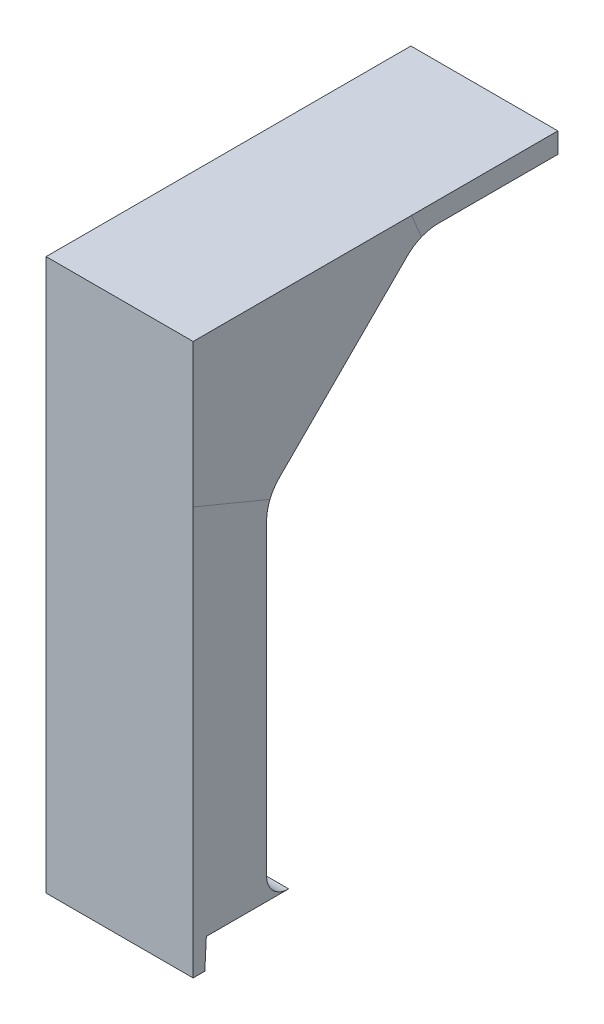
ISO-10303-21;
HEADER;
FILE_DESCRIPTION(('STEP AP214'),'2;1');
FILE_NAME('part.step','',(''),(''),'','','');
FILE_SCHEMA(('AUTOMOTIVE_DESIGN { 1 0 10303 214 1 1 1 1 }'));
ENDSEC;
DATA;
#1=APPLICATION_CONTEXT('core data for automotive mechanical design processes');
#2=APPLICATION_PROTOCOL_DEFINITION('international standard','automotive_design',2000,#1);
#3=PRODUCT_CONTEXT('',#1,'mechanical');
#4=PRODUCT('Part','Part','',(#3));
#5=PRODUCT_RELATED_PRODUCT_CATEGORY('part','',(#4));
#6=PRODUCT_DEFINITION_FORMATION('','',#4);
#7=PRODUCT_DEFINITION_CONTEXT('part definition',#1,'design');
#8=PRODUCT_DEFINITION('design','',#6,#7);
#9=PRODUCT_DEFINITION_SHAPE('','',#8);
#10=(LENGTH_UNIT() NAMED_UNIT(*) SI_UNIT(.MILLI.,.METRE.));
#11=(NAMED_UNIT(*) PLANE_ANGLE_UNIT() SI_UNIT($,.RADIAN.));
#12=(NAMED_UNIT(*) SI_UNIT($,.STERADIAN.) SOLID_ANGLE_UNIT());
#13=UNCERTAINTY_MEASURE_WITH_UNIT(LENGTH_MEASURE(1.E-05),#10,'distance_accuracy_value','');
#14=(GEOMETRIC_REPRESENTATION_CONTEXT(3) GLOBAL_UNCERTAINTY_ASSIGNED_CONTEXT((#13)) GLOBAL_UNIT_ASSIGNED_CONTEXT((#10,
#11,#12)) REPRESENTATION_CONTEXT('',''));
#15=CARTESIAN_POINT('',(0.,0.,0.));
#16=DIRECTION('',(0.,0.,1.));
#17=DIRECTION('',(1.,0.,0.));
#18=AXIS2_PLACEMENT_3D('',#15,#16,#17);
#19=CARTESIAN_POINT('',(0.,5.,0.));
#20=DIRECTION('',(0.,1.,0.));
#21=DIRECTION('',(0.,0.,1.));
#22=AXIS2_PLACEMENT_3D('',#19,#20,#21);
#23=PLANE('',#22);
#24=DIRECTION('',(0.,0.,-1.));
#25=VECTOR('',#24,1.);
#26=CARTESIAN_POINT('',(-31.5,5.,10.));
#27=LINE('',#26,#25);
#28=CARTESIAN_POINT('',(-31.5,5.,64.1000000000001));
#29=VERTEX_POINT('',#28);
#30=CARTESIAN_POINT('',(-31.5,5.,58.5000000000001));
#31=VERTEX_POINT('',#30);
#32=EDGE_CURVE('E206',#29,#31,#27,.T.);
#33=ORIENTED_EDGE('',*,*,#32,.F.);
#34=DIRECTION('',(-1.,0.,0.));
#35=VECTOR('',#34,1.);
#36=CARTESIAN_POINT('',(0.,5.,64.1000000000001));
#37=LINE('',#36,#35);
#38=CARTESIAN_POINT('',(-41.5,5.,64.1000000000001));
#39=VERTEX_POINT('',#38);
#40=EDGE_CURVE('E222',#29,#39,#37,.T.);
#41=ORIENTED_EDGE('',*,*,#40,.T.);
#42=DIRECTION('',(0.,0.,1.));
#43=VECTOR('',#42,1.);
#44=CARTESIAN_POINT('',(-41.5,5.,10.));
#45=LINE('',#44,#43);
#46=CARTESIAN_POINT('',(-41.5,5.,58.5000000000001));
#47=VERTEX_POINT('',#46);
#48=EDGE_CURVE('E36',#47,#39,#45,.T.);
#49=ORIENTED_EDGE('',*,*,#48,.F.);
#50=DIRECTION('',(-1.,0.,0.));
#51=VECTOR('',#50,1.);
#52=CARTESIAN_POINT('',(0.,5.,58.5000000000001));
#53=LINE('',#52,#51);
#54=EDGE_CURVE('E202',#47,#31,#53,.F.);
#55=ORIENTED_EDGE('',*,*,#54,.T.);
#56=EDGE_LOOP('',(#33,#41,#49,#55));
#57=FACE_BOUND('',#56,.T.);
#58=ADVANCED_FACE('F32',(#57),#23,.F.);
#59=CARTESIAN_POINT('',(0.,-20.8862915010153,40.1862915010152));
#60=DIRECTION('',(0.,0.,1.));
#61=DIRECTION('',(0.,-1.,0.));
#62=AXIS2_PLACEMENT_3D('',#59,#60,#61);
#63=PLANE('',#62);
#64=DIRECTION('',(0.,1.,0.));
#65=VECTOR('',#64,1.);
#66=CARTESIAN_POINT('',(-41.5,44.1137084989847,40.1862915010153));
#67=LINE('',#66,#65);
#68=CARTESIAN_POINT('',(-41.5,39.1137084989847,40.1862915010153));
#69=VERTEX_POINT('',#68);
#70=CARTESIAN_POINT('',(-41.5,40.5,40.1862915010153));
#71=VERTEX_POINT('',#70);
#72=EDGE_CURVE('E186',#69,#71,#67,.T.);
#73=ORIENTED_EDGE('',*,*,#72,.T.);
#74=DIRECTION('',(1.,0.,0.));
#75=VECTOR('',#74,1.);
#76=CARTESIAN_POINT('',(0.,40.5,40.1862915010153));
#77=LINE('',#76,#75);
#78=CARTESIAN_POINT('',(-31.5,40.5,40.1862915010153));
#79=VERTEX_POINT('',#78);
#80=EDGE_CURVE('E182',#71,#79,#77,.T.);
#81=ORIENTED_EDGE('',*,*,#80,.T.);
#82=DIRECTION('',(0.,-1.,0.));
#83=VECTOR('',#82,1.);
#84=CARTESIAN_POINT('',(-31.5,44.1137084989847,40.1862915010153));
#85=LINE('',#84,#83);
#86=CARTESIAN_POINT('',(-31.5,39.1137084989847,40.1862915010153));
#87=VERTEX_POINT('',#86);
#88=EDGE_CURVE('E185',#79,#87,#85,.T.);
#89=ORIENTED_EDGE('',*,*,#88,.T.);
#90=DIRECTION('',(-1.,0.,0.));
#91=VECTOR('',#90,1.);
#92=CARTESIAN_POINT('',(-41.5,39.1137084989847,40.1862915010153));
#93=LINE('',#92,#91);
#94=EDGE_CURVE('E199',#87,#69,#93,.T.);
#95=ORIENTED_EDGE('',*,*,#94,.T.);
#96=EDGE_LOOP('',(#73,#81,#89,#95));
#97=FACE_BOUND('',#96,.T.);
#98=ADVANCED_FACE('F34',(#97),#63,.F.);
#99=CARTESIAN_POINT('',(-41.5,39.1137084989847,51.8810137161517));
#100=DIRECTION('',(0.,-1.,0.));
#101=DIRECTION('',(0.,0.,-1.));
#102=AXIS2_PLACEMENT_3D('',#99,#100,#101);
#103=PLANE('',#102);
#104=DIRECTION('',(0.,0.,-1.));
#105=VECTOR('',#104,1.);
#106=CARTESIAN_POINT('',(-31.5,39.1137084989847,51.8810137161517));
#107=LINE('',#106,#105);
#108=CARTESIAN_POINT('',(-31.5,39.1137084989847,48.3223304703363));
#109=VERTEX_POINT('',#108);
#110=EDGE_CURVE('E240',#109,#87,#107,.T.);
#111=ORIENTED_EDGE('',*,*,#110,.F.);
#112=DIRECTION('',(1.,0.,0.));
#113=VECTOR('',#112,1.);
#114=CARTESIAN_POINT('',(-41.5,39.1137084989847,48.3223304703363));
#115=LINE('',#114,#113);
#116=CARTESIAN_POINT('',(-41.5,39.1137084989847,48.3223304703363));
#117=VERTEX_POINT('',#116);
#118=EDGE_CURVE('E252',#109,#117,#115,.F.);
#119=ORIENTED_EDGE('',*,*,#118,.T.);
#120=DIRECTION('',(0.,0.,-1.));
#121=VECTOR('',#120,1.);
#122=CARTESIAN_POINT('',(-41.5,39.1137084989847,51.8810137161517));
#123=LINE('',#122,#121);
#124=EDGE_CURVE('E238',#117,#69,#123,.T.);
#125=ORIENTED_EDGE('',*,*,#124,.T.);
#126=ORIENTED_EDGE('',*,*,#94,.F.);
#127=EDGE_LOOP('',(#111,#119,#125,#126));
#128=FACE_BOUND('',#127,.T.);
#129=ADVANCED_FACE('F312',(#128),#103,.T.);
#130=CARTESIAN_POINT('',(-41.5,44.1137084989847,51.8810137161517));
#131=DIRECTION('',(-1.,0.,0.));
#132=DIRECTION('',(0.,0.,1.));
#133=AXIS2_PLACEMENT_3D('',#130,#131,#132);
#134=PLANE('',#133);
#135=DIRECTION('',(0.,0.,1.));
#136=VECTOR('',#135,1.);
#137=CARTESIAN_POINT('',(-41.5,40.5,51.8810137161517));
#138=LINE('',#137,#136);
#139=CARTESIAN_POINT('',(-41.5,40.5,50.1391918985787));
#140=VERTEX_POINT('',#139);
#141=EDGE_CURVE('E11',#71,#140,#138,.T.);
#142=ORIENTED_EDGE('',*,*,#141,.F.);
#143=ORIENTED_EDGE('',*,*,#72,.F.);
#144=ORIENTED_EDGE('',*,*,#124,.F.);
#145=CARTESIAN_POINT('',(-41.5,36.1137084989847,48.3223304703363));
#146=DIRECTION('',(-1.,0.,0.));
#147=DIRECTION('',(0.,0.,1.));
#148=AXIS2_PLACEMENT_3D('',#145,#146,#147);
#149=CIRCLE('',#148,3.);
#150=CARTESIAN_POINT('',(-41.5,38.8853470965186,49.4703807674316));
#151=VERTEX_POINT('',#150);
#152=EDGE_CURVE('E234',#117,#151,#149,.F.);
#153=ORIENTED_EDGE('',*,*,#152,.T.);
#154=DIRECTION('',(0.,-0.923879532511287,-0.382683432365089));
#155=VECTOR('',#154,1.);
#156=CARTESIAN_POINT('',(-41.5,37.3451163312936,48.8323962952911));
#157=LINE('',#156,#155);
#158=EDGE_CURVE('E189',#140,#151,#157,.T.);
#159=ORIENTED_EDGE('',*,*,#158,.F.);
#160=EDGE_LOOP('',(#142,#143,#144,#153,#159));
#161=FACE_BOUND('',#160,.T.);
#162=ADVANCED_FACE('F307',(#161),#134,.T.);
#163=CARTESIAN_POINT('',(-31.5,44.1137084989847,51.8810137161517));
#164=DIRECTION('',(1.,0.,0.));
#165=DIRECTION('',(0.,0.,-1.));
#166=AXIS2_PLACEMENT_3D('',#163,#164,#165);
#167=PLANE('',#166);
#168=DIRECTION('',(0.,0.,-1.));
#169=VECTOR('',#168,1.);
#170=CARTESIAN_POINT('',(-31.5,40.5,51.8810137161517));
#171=LINE('',#170,#169);
#172=CARTESIAN_POINT('',(-31.5,40.5,50.1391918985787));
#173=VERTEX_POINT('',#172);
#174=EDGE_CURVE('E42',#173,#79,#171,.T.);
#175=ORIENTED_EDGE('',*,*,#174,.F.);
#176=DIRECTION('',(0.,0.923879532511287,0.382683432365089));
#177=VECTOR('',#176,1.);
#178=CARTESIAN_POINT('',(-31.5,37.3451163312936,48.8323962952911));
#179=LINE('',#178,#177);
#180=CARTESIAN_POINT('',(-31.5,38.8853470965186,49.4703807674316));
#181=VERTEX_POINT('',#180);
#182=EDGE_CURVE('E193',#181,#173,#179,.T.);
#183=ORIENTED_EDGE('',*,*,#182,.F.);
#184=CARTESIAN_POINT('',(-31.5,36.1137084989847,48.3223304703363));
#185=DIRECTION('',(1.,0.,0.));
#186=DIRECTION('',(0.,0.,-1.));
#187=AXIS2_PLACEMENT_3D('',#184,#185,#186);
#188=CIRCLE('',#187,3.);
#189=EDGE_CURVE('E237',#181,#109,#188,.F.);
#190=ORIENTED_EDGE('',*,*,#189,.T.);
#191=ORIENTED_EDGE('',*,*,#110,.T.);
#192=ORIENTED_EDGE('',*,*,#88,.F.);
#193=EDGE_LOOP('',(#175,#183,#190,#191,#192));
#194=FACE_BOUND('',#193,.T.);
#195=ADVANCED_FACE('F316',(#194),#167,.T.);
#196=CARTESIAN_POINT('',(-41.5,36.1137084989847,48.3223304703363));
#197=DIRECTION('',(-1.,0.,0.));
#198=DIRECTION('',(0.,0.,1.));
#199=AXIS2_PLACEMENT_3D('',#196,#197,#198);
#200=CYLINDRICAL_SURFACE('',#199,3.);
#201=ORIENTED_EDGE('',*,*,#152,.F.);
#202=ORIENTED_EDGE('',*,*,#118,.F.);
#203=ORIENTED_EDGE('',*,*,#189,.F.);
#204=CARTESIAN_POINT('',(-31.5,36.1137084989847,48.3223304703363));
#205=DIRECTION('',(1.,0.,0.));
#206=DIRECTION('',(0.,0.,-1.));
#207=AXIS2_PLACEMENT_3D('',#204,#205,#206);
#208=CIRCLE('',#207,3.);
#209=CARTESIAN_POINT('',(-31.5,38.2350288425444,50.443650813896));
#210=VERTEX_POINT('',#209);
#211=EDGE_CURVE('E197',#210,#181,#208,.F.);
#212=ORIENTED_EDGE('',*,*,#211,.F.);
#213=DIRECTION('',(1.,0.,0.));
#214=VECTOR('',#213,1.);
#215=CARTESIAN_POINT('',(-31.5,38.2350288425444,50.443650813896));
#216=LINE('',#215,#214);
#217=CARTESIAN_POINT('',(-41.5,38.2350288425444,50.443650813896));
#218=VERTEX_POINT('',#217);
#219=EDGE_CURVE('E192',#218,#210,#216,.T.);
#220=ORIENTED_EDGE('',*,*,#219,.F.);
#221=CARTESIAN_POINT('',(-41.5,36.1137084989847,48.3223304703363));
#222=DIRECTION('',(-1.,0.,0.));
#223=DIRECTION('',(0.,0.,1.));
#224=AXIS2_PLACEMENT_3D('',#221,#222,#223);
#225=CIRCLE('',#224,3.);
#226=EDGE_CURVE('E191',#151,#218,#225,.F.);
#227=ORIENTED_EDGE('',*,*,#226,.F.);
#228=EDGE_LOOP('',(#201,#202,#203,#212,#220,#227));
#229=FACE_BOUND('',#228,.T.);
#230=ADVANCED_FACE('F298',(#229),#200,.F.);
#231=CARTESIAN_POINT('',(-41.5,27.0409902576697,61.6376893987707));
#232=DIRECTION('',(0.,-0.70710678118655,-0.707106781186545));
#233=DIRECTION('',(0.,0.707106781186545,-0.70710678118655));
#234=AXIS2_PLACEMENT_3D('',#231,#232,#233);
#235=PLANE('',#234);
#236=DIRECTION('',(0.,0.707106781186545,-0.70710678118655));
#237=VECTOR('',#236,1.);
#238=CARTESIAN_POINT('',(-31.5,27.0409902576697,61.6376893987707));
#239=LINE('',#238,#237);
#240=CARTESIAN_POINT('',(-31.5,29.5573593128807,59.1213203435597));
#241=VERTEX_POINT('',#240);
#242=EDGE_CURVE('E243',#241,#210,#239,.T.);
#243=ORIENTED_EDGE('',*,*,#242,.F.);
#244=DIRECTION('',(1.,0.,0.));
#245=VECTOR('',#244,1.);
#246=CARTESIAN_POINT('',(-41.5,29.5573593128807,59.1213203435597));
#247=LINE('',#246,#245);
#248=CARTESIAN_POINT('',(-41.5,29.5573593128807,59.1213203435597));
#249=VERTEX_POINT('',#248);
#250=EDGE_CURVE('E254',#241,#249,#247,.F.);
#251=ORIENTED_EDGE('',*,*,#250,.T.);
#252=DIRECTION('',(0.,0.707106781186545,-0.70710678118655));
#253=VECTOR('',#252,1.);
#254=CARTESIAN_POINT('',(-41.5,27.0409902576697,61.6376893987707));
#255=LINE('',#254,#253);
#256=EDGE_CURVE('E256',#249,#218,#255,.T.);
#257=ORIENTED_EDGE('',*,*,#256,.T.);
#258=ORIENTED_EDGE('',*,*,#219,.T.);
#259=EDGE_LOOP('',(#243,#251,#257,#258));
#260=FACE_BOUND('',#259,.T.);
#261=ADVANCED_FACE('F295',(#260),#235,.T.);
#262=CARTESIAN_POINT('',(-41.5,30.5765241636025,65.1732233047034));
#263=DIRECTION('',(-1.,0.,0.));
#264=DIRECTION('',(0.,0.,1.));
#265=AXIS2_PLACEMENT_3D('',#262,#263,#264);
#266=PLANE('',#265);
#267=DIRECTION('',(0.,0.,1.));
#268=VECTOR('',#267,1.);
#269=CARTESIAN_POINT('',(-41.5,40.5,65.1732233047034));
#270=LINE('',#269,#268);
#271=CARTESIAN_POINT('',(-41.5,40.5,65.0000000000001));
#272=VERTEX_POINT('',#271);
#273=EDGE_CURVE('E69',#140,#272,#270,.T.);
#274=ORIENTED_EDGE('',*,*,#273,.F.);
#275=ORIENTED_EDGE('',*,*,#158,.T.);
#276=ORIENTED_EDGE('',*,*,#226,.T.);
#277=ORIENTED_EDGE('',*,*,#256,.F.);
#278=CARTESIAN_POINT('',(-41.5,27.4360389693211,57.0000000000001));
#279=DIRECTION('',(-1.,0.,0.));
#280=DIRECTION('',(0.,0.,1.));
#281=AXIS2_PLACEMENT_3D('',#278,#279,#280);
#282=CIRCLE('',#281,3.);
#283=CARTESIAN_POINT('',(-41.5,28.5840892664163,59.7716385975339));
#284=VERTEX_POINT('',#283);
#285=EDGE_CURVE('E205',#249,#284,#282,.F.);
#286=ORIENTED_EDGE('',*,*,#285,.T.);
#287=DIRECTION('',(0.,-0.382683432365091,-0.923879532511286));
#288=VECTOR('',#287,1.);
#289=CARTESIAN_POINT('',(-41.5,26.978784258493,55.8960894756599));
#290=LINE('',#289,#288);
#291=CARTESIAN_POINT('',(-41.5,30.7497474683058,65.0000000000001));
#292=VERTEX_POINT('',#291);
#293=EDGE_CURVE('E173',#292,#284,#290,.T.);
#294=ORIENTED_EDGE('',*,*,#293,.F.);
#295=DIRECTION('',(0.,1.,0.));
#296=VECTOR('',#295,1.);
#297=CARTESIAN_POINT('',(-41.5,44.1137084989847,65.0000000000001));
#298=LINE('',#297,#296);
#299=EDGE_CURVE('E153',#292,#272,#298,.T.);
#300=ORIENTED_EDGE('',*,*,#299,.T.);
#301=EDGE_LOOP('',(#274,#275,#276,#277,#286,#294,#300));
#302=FACE_BOUND('',#301,.T.);
#303=ADVANCED_FACE('F290',(#302),#266,.T.);
#304=CARTESIAN_POINT('',(-31.5,30.5765241636025,65.1732233047034));
#305=DIRECTION('',(1.,0.,0.));
#306=DIRECTION('',(0.,0.,-1.));
#307=AXIS2_PLACEMENT_3D('',#304,#305,#306);
#308=PLANE('',#307);
#309=DIRECTION('',(0.,0.,-1.));
#310=VECTOR('',#309,1.);
#311=CARTESIAN_POINT('',(-31.5,40.5,65.1732233047034));
#312=LINE('',#311,#310);
#313=CARTESIAN_POINT('',(-31.5,40.5,65.0000000000001));
#314=VERTEX_POINT('',#313);
#315=EDGE_CURVE('E62',#314,#173,#312,.T.);
#316=ORIENTED_EDGE('',*,*,#315,.F.);
#317=DIRECTION('',(0.,1.,0.));
#318=VECTOR('',#317,1.);
#319=CARTESIAN_POINT('',(-31.5,44.1137084989847,65.0000000000001));
#320=LINE('',#319,#318);
#321=CARTESIAN_POINT('',(-31.5,30.7497474683058,65.0000000000001));
#322=VERTEX_POINT('',#321);
#323=EDGE_CURVE('E196',#322,#314,#320,.T.);
#324=ORIENTED_EDGE('',*,*,#323,.F.);
#325=DIRECTION('',(0.,0.382683432365091,0.923879532511286));
#326=VECTOR('',#325,1.);
#327=CARTESIAN_POINT('',(-31.5,26.978784258493,55.8960894756599));
#328=LINE('',#327,#326);
#329=CARTESIAN_POINT('',(-31.5,28.5840892664163,59.7716385975339));
#330=VERTEX_POINT('',#329);
#331=EDGE_CURVE('E221',#330,#322,#328,.T.);
#332=ORIENTED_EDGE('',*,*,#331,.F.);
#333=CARTESIAN_POINT('',(-31.5,27.4360389693211,57.0000000000001));
#334=DIRECTION('',(1.,0.,0.));
#335=DIRECTION('',(0.,0.,-1.));
#336=AXIS2_PLACEMENT_3D('',#333,#334,#335);
#337=CIRCLE('',#336,3.);
#338=EDGE_CURVE('E204',#330,#241,#337,.F.);
#339=ORIENTED_EDGE('',*,*,#338,.T.);
#340=ORIENTED_EDGE('',*,*,#242,.T.);
#341=ORIENTED_EDGE('',*,*,#211,.T.);
#342=ORIENTED_EDGE('',*,*,#182,.T.);
#343=EDGE_LOOP('',(#316,#324,#332,#339,#340,#341,#342));
#344=FACE_BOUND('',#343,.T.);
#345=ADVANCED_FACE('F302',(#344),#308,.T.);
#346=CARTESIAN_POINT('',(-41.5,27.4360389693211,57.0000000000001));
#347=DIRECTION('',(-1.,0.,0.));
#348=DIRECTION('',(0.,0.,1.));
#349=AXIS2_PLACEMENT_3D('',#346,#347,#348);
#350=CYLINDRICAL_SURFACE('',#349,3.);
#351=ORIENTED_EDGE('',*,*,#285,.F.);
#352=ORIENTED_EDGE('',*,*,#250,.F.);
#353=ORIENTED_EDGE('',*,*,#338,.F.);
#354=CARTESIAN_POINT('',(-31.5,27.4360389693211,57.0000000000001));
#355=DIRECTION('',(-1.,0.,0.));
#356=DIRECTION('',(0.,0.,1.));
#357=AXIS2_PLACEMENT_3D('',#354,#355,#356);
#358=CIRCLE('',#357,3.);
#359=CARTESIAN_POINT('',(-31.5,27.4360389693211,60.0000000000001));
#360=VERTEX_POINT('',#359);
#361=EDGE_CURVE('E249',#360,#330,#358,.T.);
#362=ORIENTED_EDGE('',*,*,#361,.F.);
#363=DIRECTION('',(1.,0.,0.));
#364=VECTOR('',#363,1.);
#365=CARTESIAN_POINT('',(-31.5,27.4360389693211,60.0000000000001));
#366=LINE('',#365,#364);
#367=CARTESIAN_POINT('',(-41.5,27.4360389693211,60.0000000000001));
#368=VERTEX_POINT('',#367);
#369=EDGE_CURVE('E259',#368,#360,#366,.T.);
#370=ORIENTED_EDGE('',*,*,#369,.F.);
#371=CARTESIAN_POINT('',(-41.5,27.4360389693211,57.0000000000001));
#372=DIRECTION('',(1.,0.,0.));
#373=DIRECTION('',(0.,0.,-1.));
#374=AXIS2_PLACEMENT_3D('',#371,#372,#373);
#375=CIRCLE('',#374,3.);
#376=EDGE_CURVE('E175',#284,#368,#375,.T.);
#377=ORIENTED_EDGE('',*,*,#376,.F.);
#378=EDGE_LOOP('',(#351,#352,#353,#362,#370,#377));
#379=FACE_BOUND('',#378,.T.);
#380=ADVANCED_FACE('F283',(#379),#350,.F.);
#381=CARTESIAN_POINT('',(-41.5,5.,65.0000000000001));
#382=DIRECTION('',(0.,0.,-1.));
#383=DIRECTION('',(-1.,0.,0.));
#384=AXIS2_PLACEMENT_3D('',#381,#382,#383);
#385=PLANE('',#384);
#386=ORIENTED_EDGE('',*,*,#323,.T.);
#387=DIRECTION('',(-1.,0.,0.));
#388=VECTOR('',#387,1.);
#389=CARTESIAN_POINT('',(-41.5,40.5,65.0000000000001));
#390=LINE('',#389,#388);
#391=EDGE_CURVE('E66',#314,#272,#390,.T.);
#392=ORIENTED_EDGE('',*,*,#391,.T.);
#393=ORIENTED_EDGE('',*,*,#299,.F.);
#394=DIRECTION('',(0.,-1.,0.));
#395=VECTOR('',#394,1.);
#396=CARTESIAN_POINT('',(-41.5,5.,65.0000000000001));
#397=LINE('',#396,#395);
#398=CARTESIAN_POINT('',(-41.5,3.,65.0000000000001));
#399=VERTEX_POINT('',#398);
#400=EDGE_CURVE('E146',#292,#399,#397,.T.);
#401=ORIENTED_EDGE('',*,*,#400,.T.);
#402=DIRECTION('',(1.,0.,0.));
#403=VECTOR('',#402,1.);
#404=CARTESIAN_POINT('',(-41.5,3.,65.0000000000001));
#405=LINE('',#404,#403);
#406=CARTESIAN_POINT('',(-31.5,3.,65.0000000000001));
#407=VERTEX_POINT('',#406);
#408=EDGE_CURVE('E151',#399,#407,#405,.T.);
#409=ORIENTED_EDGE('',*,*,#408,.T.);
#410=DIRECTION('',(0.,-1.,0.));
#411=VECTOR('',#410,1.);
#412=CARTESIAN_POINT('',(-31.5,5.,65.0000000000001));
#413=LINE('',#412,#411);
#414=EDGE_CURVE('E216',#322,#407,#413,.T.);
#415=ORIENTED_EDGE('',*,*,#414,.F.);
#416=EDGE_LOOP('',(#386,#392,#393,#401,#409,#415));
#417=FACE_BOUND('',#416,.T.);
#418=ADVANCED_FACE('F149',(#417),#385,.F.);
#419=CARTESIAN_POINT('',(-41.5,5.,60.0000000000001));
#420=DIRECTION('',(0.,0.,-1.));
#421=DIRECTION('',(-1.,0.,0.));
#422=AXIS2_PLACEMENT_3D('',#419,#420,#421);
#423=PLANE('',#422);
#424=DIRECTION('',(0.,1.,0.));
#425=VECTOR('',#424,1.);
#426=CARTESIAN_POINT('',(-31.5,5.,60.0000000000001));
#427=LINE('',#426,#425);
#428=CARTESIAN_POINT('',(-31.5,6.5,60.0000000000001));
#429=VERTEX_POINT('',#428);
#430=EDGE_CURVE('E213',#429,#360,#427,.T.);
#431=ORIENTED_EDGE('',*,*,#430,.F.);
#432=DIRECTION('',(-1.,0.,0.));
#433=VECTOR('',#432,1.);
#434=CARTESIAN_POINT('',(-41.5,6.5,60.0000000000001));
#435=LINE('',#434,#433);
#436=CARTESIAN_POINT('',(-41.5,6.5,60.0000000000001));
#437=VERTEX_POINT('',#436);
#438=EDGE_CURVE('E167',#429,#437,#435,.T.);
#439=ORIENTED_EDGE('',*,*,#438,.T.);
#440=DIRECTION('',(0.,1.,0.));
#441=VECTOR('',#440,1.);
#442=CARTESIAN_POINT('',(-41.5,5.,60.0000000000001));
#443=LINE('',#442,#441);
#444=EDGE_CURVE('E232',#437,#368,#443,.T.);
#445=ORIENTED_EDGE('',*,*,#444,.T.);
#446=ORIENTED_EDGE('',*,*,#369,.T.);
#447=EDGE_LOOP('',(#431,#439,#445,#446));
#448=FACE_BOUND('',#447,.T.);
#449=ADVANCED_FACE('F286',(#448),#423,.T.);
#450=CARTESIAN_POINT('',(-41.5,5.,10.));
#451=DIRECTION('',(1.,0.,0.));
#452=DIRECTION('',(0.,0.,-1.));
#453=AXIS2_PLACEMENT_3D('',#450,#451,#452);
#454=PLANE('',#453);
#455=CARTESIAN_POINT('',(-41.5,6.5,58.5000000000001));
#456=DIRECTION('',(1.,0.,0.));
#457=DIRECTION('',(0.,0.,-1.));
#458=AXIS2_PLACEMENT_3D('',#455,#456,#457);
#459=CIRCLE('',#458,1.5);
#460=EDGE_CURVE('E177',#437,#47,#459,.T.);
#461=ORIENTED_EDGE('',*,*,#460,.T.);
#462=ORIENTED_EDGE('',*,*,#48,.T.);
#463=DIRECTION('',(0.,0.998629534754574,-0.0523359562429438));
#464=VECTOR('',#463,1.);
#465=CARTESIAN_POINT('',(-41.5,5.,64.1000000000001));
#466=LINE('',#465,#464);
#467=CARTESIAN_POINT('',(-41.5,3.,64.2048155585661));
#468=VERTEX_POINT('',#467);
#469=EDGE_CURVE('E172',#468,#39,#466,.T.);
#470=ORIENTED_EDGE('',*,*,#469,.F.);
#471=DIRECTION('',(0.,0.,1.));
#472=VECTOR('',#471,1.);
#473=CARTESIAN_POINT('',(-41.5,3.,10.));
#474=LINE('',#473,#472);
#475=EDGE_CURVE('E163',#468,#399,#474,.T.);
#476=ORIENTED_EDGE('',*,*,#475,.T.);
#477=ORIENTED_EDGE('',*,*,#400,.F.);
#478=ORIENTED_EDGE('',*,*,#293,.T.);
#479=ORIENTED_EDGE('',*,*,#376,.T.);
#480=ORIENTED_EDGE('',*,*,#444,.F.);
#481=EDGE_LOOP('',(#461,#462,#470,#476,#477,#478,#479,#480));
#482=FACE_BOUND('',#481,.T.);
#483=ADVANCED_FACE('F170',(#482),#454,.F.);
#484=CARTESIAN_POINT('',(-31.5,5.,10.));
#485=DIRECTION('',(-1.,0.,0.));
#486=DIRECTION('',(0.,0.,1.));
#487=AXIS2_PLACEMENT_3D('',#484,#485,#486);
#488=PLANE('',#487);
#489=ORIENTED_EDGE('',*,*,#414,.T.);
#490=DIRECTION('',(0.,0.,-1.));
#491=VECTOR('',#490,1.);
#492=CARTESIAN_POINT('',(-31.5,3.,10.));
#493=LINE('',#492,#491);
#494=CARTESIAN_POINT('',(-31.5,3.,64.2048155585661));
#495=VERTEX_POINT('',#494);
#496=EDGE_CURVE('E166',#407,#495,#493,.T.);
#497=ORIENTED_EDGE('',*,*,#496,.T.);
#498=DIRECTION('',(0.,0.998629534754574,-0.0523359562429438));
#499=VECTOR('',#498,1.);
#500=CARTESIAN_POINT('',(-31.5,5.83297303602175,64.0563457329795));
#501=LINE('',#500,#499);
#502=EDGE_CURVE('E208',#495,#29,#501,.T.);
#503=ORIENTED_EDGE('',*,*,#502,.T.);
#504=ORIENTED_EDGE('',*,*,#32,.T.);
#505=CARTESIAN_POINT('',(-31.5,6.5,58.5000000000001));
#506=DIRECTION('',(-1.,0.,0.));
#507=DIRECTION('',(0.,0.,1.));
#508=AXIS2_PLACEMENT_3D('',#505,#506,#507);
#509=CIRCLE('',#508,1.5);
#510=EDGE_CURVE('E207',#31,#429,#509,.T.);
#511=ORIENTED_EDGE('',*,*,#510,.T.);
#512=ORIENTED_EDGE('',*,*,#430,.T.);
#513=ORIENTED_EDGE('',*,*,#361,.T.);
#514=ORIENTED_EDGE('',*,*,#331,.T.);
#515=EDGE_LOOP('',(#489,#497,#503,#504,#511,#512,#513,#514));
#516=FACE_BOUND('',#515,.T.);
#517=ADVANCED_FACE('F276',(#516),#488,.F.);
#518=CARTESIAN_POINT('',(-41.5,6.5,58.5000000000001));
#519=DIRECTION('',(-1.,0.,0.));
#520=DIRECTION('',(0.,0.,1.));
#521=AXIS2_PLACEMENT_3D('',#518,#519,#520);
#522=CYLINDRICAL_SURFACE('',#521,1.5);
#523=ORIENTED_EDGE('',*,*,#510,.F.);
#524=ORIENTED_EDGE('',*,*,#54,.F.);
#525=ORIENTED_EDGE('',*,*,#460,.F.);
#526=ORIENTED_EDGE('',*,*,#438,.F.);
#527=EDGE_LOOP('',(#523,#524,#525,#526));
#528=FACE_BOUND('',#527,.T.);
#529=ADVANCED_FACE('F327',(#528),#522,.F.);
#530=CARTESIAN_POINT('',(0.,5.,64.1000000000001));
#531=DIRECTION('',(0.,-0.0523359562429438,-0.998629534754574));
#532=DIRECTION('',(0.,0.998629534754574,-0.0523359562429438));
#533=AXIS2_PLACEMENT_3D('',#530,#531,#532);
#534=PLANE('',#533);
#535=ORIENTED_EDGE('',*,*,#40,.F.);
#536=ORIENTED_EDGE('',*,*,#502,.F.);
#537=DIRECTION('',(-1.,0.,0.));
#538=VECTOR('',#537,1.);
#539=CARTESIAN_POINT('',(0.,3.,64.2048155585662));
#540=LINE('',#539,#538);
#541=EDGE_CURVE('E219',#495,#468,#540,.T.);
#542=ORIENTED_EDGE('',*,*,#541,.T.);
#543=ORIENTED_EDGE('',*,*,#469,.T.);
#544=EDGE_LOOP('',(#535,#536,#542,#543));
#545=FACE_BOUND('',#544,.T.);
#546=ADVANCED_FACE('F320',(#545),#534,.T.);
#547=CARTESIAN_POINT('',(0.,3.,0.));
#548=DIRECTION('',(0.,1.,0.));
#549=DIRECTION('',(0.,0.,1.));
#550=AXIS2_PLACEMENT_3D('',#547,#548,#549);
#551=PLANE('',#550);
#552=ORIENTED_EDGE('',*,*,#541,.F.);
#553=ORIENTED_EDGE('',*,*,#496,.F.);
#554=ORIENTED_EDGE('',*,*,#408,.F.);
#555=ORIENTED_EDGE('',*,*,#475,.F.);
#556=EDGE_LOOP('',(#552,#553,#554,#555));
#557=FACE_BOUND('',#556,.T.);
#558=ADVANCED_FACE('F162',(#557),#551,.F.);
#559=CARTESIAN_POINT('',(-73.,40.5,0.));
#560=DIRECTION('',(0.,-1.,0.));
#561=DIRECTION('',(0.,0.,-1.));
#562=AXIS2_PLACEMENT_3D('',#559,#560,#561);
#563=PLANE('',#562);
#564=ORIENTED_EDGE('',*,*,#273,.T.);
#565=ORIENTED_EDGE('',*,*,#391,.F.);
#566=ORIENTED_EDGE('',*,*,#315,.T.);
#567=ORIENTED_EDGE('',*,*,#174,.T.);
#568=ORIENTED_EDGE('',*,*,#80,.F.);
#569=ORIENTED_EDGE('',*,*,#141,.T.);
#570=EDGE_LOOP('',(#564,#565,#566,#567,#568,#569));
#571=FACE_BOUND('',#570,.T.);
#572=ADVANCED_FACE('F317',(#571),#563,.F.);
#573=CLOSED_SHELL('',(#58,#98,#129,#162,#195,#230,#261,#303,#345,#380,#418,#449,#483,#517,#529,
#546,#558,#572));
#574=MANIFOLD_SOLID_BREP('B2',#573);
#575=ADVANCED_BREP_SHAPE_REPRESENTATION('',(#18,#574),#14);
#576=SHAPE_DEFINITION_REPRESENTATION(#9,#575);
ENDSEC;
END-ISO-10303-21;
